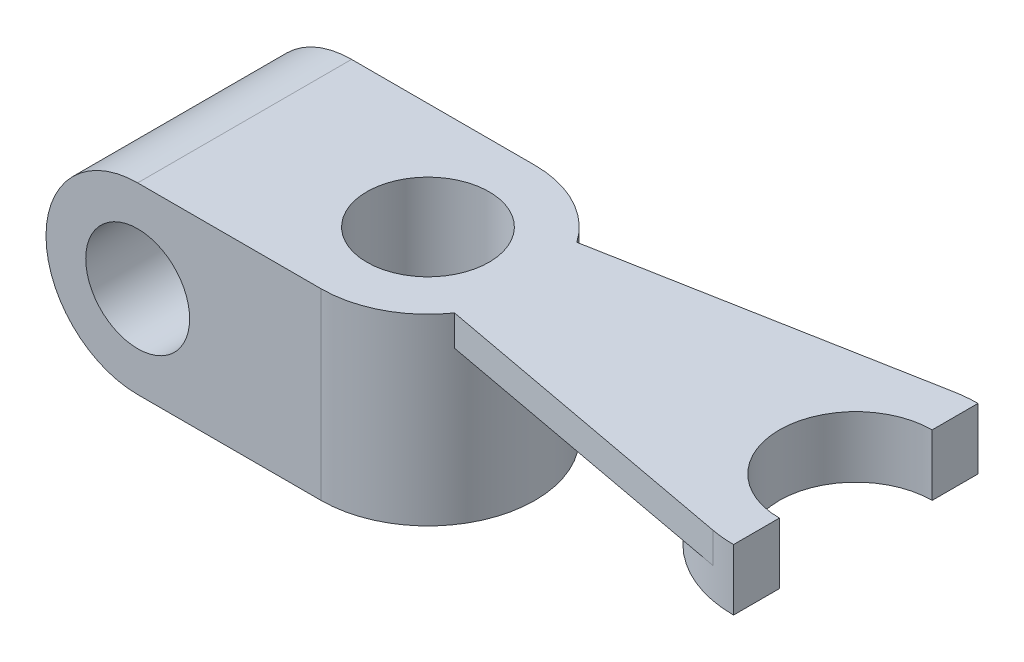
ISO-10303-21;
HEADER;
FILE_DESCRIPTION(('STEP AP214'),'2;1');
FILE_NAME('part.step','',(''),(''),'','','');
FILE_SCHEMA(('AUTOMOTIVE_DESIGN { 1 0 10303 214 1 1 1 1 }'));
ENDSEC;
DATA;
#1=APPLICATION_CONTEXT('core data for automotive mechanical design processes');
#2=APPLICATION_PROTOCOL_DEFINITION('international standard','automotive_design',2000,#1);
#3=PRODUCT_CONTEXT('',#1,'mechanical');
#4=PRODUCT('Part','Part','',(#3));
#5=PRODUCT_RELATED_PRODUCT_CATEGORY('part','',(#4));
#6=PRODUCT_DEFINITION_FORMATION('','',#4);
#7=PRODUCT_DEFINITION_CONTEXT('part definition',#1,'design');
#8=PRODUCT_DEFINITION('design','',#6,#7);
#9=PRODUCT_DEFINITION_SHAPE('','',#8);
#10=(LENGTH_UNIT() NAMED_UNIT(*) SI_UNIT(.MILLI.,.METRE.));
#11=(NAMED_UNIT(*) PLANE_ANGLE_UNIT() SI_UNIT($,.RADIAN.));
#12=(NAMED_UNIT(*) SI_UNIT($,.STERADIAN.) SOLID_ANGLE_UNIT());
#13=UNCERTAINTY_MEASURE_WITH_UNIT(LENGTH_MEASURE(1.E-05),#10,'distance_accuracy_value','');
#14=(GEOMETRIC_REPRESENTATION_CONTEXT(3) GLOBAL_UNCERTAINTY_ASSIGNED_CONTEXT((#13)) GLOBAL_UNIT_ASSIGNED_CONTEXT((#10,
#11,#12)) REPRESENTATION_CONTEXT('',''));
#15=CARTESIAN_POINT('',(0.,0.,0.));
#16=DIRECTION('',(0.,0.,1.));
#17=DIRECTION('',(1.,0.,0.));
#18=AXIS2_PLACEMENT_3D('',#15,#16,#17);
#19=CARTESIAN_POINT('',(-45.1702315148602,30.,35.));
#20=DIRECTION('',(0.,0.,1.));
#21=DIRECTION('',(1.,0.,0.));
#22=AXIS2_PLACEMENT_3D('',#19,#20,#21);
#23=CYLINDRICAL_SURFACE('',#22,30.);
#24=DIRECTION('',(0.,0.,1.));
#25=VECTOR('',#24,1.);
#26=CARTESIAN_POINT('',(-45.1702315148602,0.,0.));
#27=LINE('',#26,#25);
#28=CARTESIAN_POINT('',(-45.1702315148602,0.,35.));
#29=VERTEX_POINT('',#28);
#30=CARTESIAN_POINT('',(-45.1702315148602,0.,-35.));
#31=VERTEX_POINT('',#30);
#32=EDGE_CURVE('E229',#29,#31,#27,.F.);
#33=ORIENTED_EDGE('',*,*,#32,.F.);
#34=CARTESIAN_POINT('',(-45.1702315148602,30.,35.));
#35=DIRECTION('',(0.,0.,1.));
#36=DIRECTION('',(1.,0.,0.));
#37=AXIS2_PLACEMENT_3D('',#34,#35,#36);
#38=CIRCLE('',#37,30.);
#39=CARTESIAN_POINT('',(-45.1702315148602,60.,35.));
#40=VERTEX_POINT('',#39);
#41=EDGE_CURVE('E47',#40,#29,#38,.T.);
#42=ORIENTED_EDGE('',*,*,#41,.F.);
#43=DIRECTION('',(0.,0.,-1.));
#44=VECTOR('',#43,1.);
#45=CARTESIAN_POINT('',(-45.1702315148602,60.,35.));
#46=LINE('',#45,#44);
#47=CARTESIAN_POINT('',(-45.1702315148602,60.,-35.));
#48=VERTEX_POINT('',#47);
#49=EDGE_CURVE('E235',#48,#40,#46,.F.);
#50=ORIENTED_EDGE('',*,*,#49,.F.);
#51=CARTESIAN_POINT('',(-45.1702315148602,30.,-35.));
#52=DIRECTION('',(0.,0.,1.));
#53=DIRECTION('',(1.,0.,0.));
#54=AXIS2_PLACEMENT_3D('',#51,#52,#53);
#55=CIRCLE('',#54,30.);
#56=EDGE_CURVE('E11',#31,#48,#55,.F.);
#57=ORIENTED_EDGE('',*,*,#56,.F.);
#58=EDGE_LOOP('',(#33,#42,#50,#57));
#59=FACE_BOUND('',#58,.T.);
#60=ADVANCED_FACE('F39',(#59),#23,.T.);
#61=CARTESIAN_POINT('',(14.8297684851398,60.,0.));
#62=DIRECTION('',(0.,-1.,0.));
#63=DIRECTION('',(0.,0.,-1.));
#64=AXIS2_PLACEMENT_3D('',#61,#62,#63);
#65=CYLINDRICAL_SURFACE('',#64,35.);
#66=DIRECTION('',(0.,1.,0.));
#67=VECTOR('',#66,1.);
#68=CARTESIAN_POINT('',(43.5427871705261,50.,-20.0140590079238));
#69=LINE('',#68,#67);
#70=CARTESIAN_POINT('',(43.5427871705261,50.,-20.0140590079238));
#71=VERTEX_POINT('',#70);
#72=CARTESIAN_POINT('',(43.5427871705261,60.,-20.0140590079238));
#73=VERTEX_POINT('',#72);
#74=EDGE_CURVE('E191',#71,#73,#69,.T.);
#75=ORIENTED_EDGE('',*,*,#74,.F.);
#76=CARTESIAN_POINT('',(14.8297684851398,50.,0.));
#77=DIRECTION('',(0.,1.,0.));
#78=DIRECTION('',(0.,0.,1.));
#79=AXIS2_PLACEMENT_3D('',#76,#77,#78);
#80=CIRCLE('',#79,35.);
#81=CARTESIAN_POINT('',(43.542787175516,50.,20.0140590007651));
#82=VERTEX_POINT('',#81);
#83=EDGE_CURVE('E173',#82,#71,#80,.T.);
#84=ORIENTED_EDGE('',*,*,#83,.F.);
#85=DIRECTION('',(0.,1.,0.));
#86=VECTOR('',#85,1.);
#87=CARTESIAN_POINT('',(43.542787175516,50.,20.0140590007651));
#88=LINE('',#87,#86);
#89=CARTESIAN_POINT('',(43.542787175516,60.,20.0140590007651));
#90=VERTEX_POINT('',#89);
#91=EDGE_CURVE('E186',#82,#90,#88,.T.);
#92=ORIENTED_EDGE('',*,*,#91,.T.);
#93=CARTESIAN_POINT('',(14.8297684851398,60.,0.));
#94=DIRECTION('',(0.,1.,0.));
#95=DIRECTION('',(0.,0.,1.));
#96=AXIS2_PLACEMENT_3D('',#93,#94,#95);
#97=CIRCLE('',#96,35.);
#98=CARTESIAN_POINT('',(14.8297684851398,60.,35.));
#99=VERTEX_POINT('',#98);
#100=EDGE_CURVE('E206',#99,#90,#97,.T.);
#101=ORIENTED_EDGE('',*,*,#100,.F.);
#102=DIRECTION('',(0.,-1.,0.));
#103=VECTOR('',#102,1.);
#104=CARTESIAN_POINT('',(14.8297684851398,60.,35.));
#105=LINE('',#104,#103);
#106=CARTESIAN_POINT('',(14.8297684851398,0.,35.));
#107=VERTEX_POINT('',#106);
#108=EDGE_CURVE('E215',#99,#107,#105,.T.);
#109=ORIENTED_EDGE('',*,*,#108,.T.);
#110=CARTESIAN_POINT('',(14.8297684851398,0.,0.));
#111=DIRECTION('',(0.,1.,0.));
#112=DIRECTION('',(0.,0.,1.));
#113=AXIS2_PLACEMENT_3D('',#110,#111,#112);
#114=CIRCLE('',#113,35.);
#115=CARTESIAN_POINT('',(14.8297684851398,0.,-35.));
#116=VERTEX_POINT('',#115);
#117=EDGE_CURVE('E218',#107,#116,#114,.T.);
#118=ORIENTED_EDGE('',*,*,#117,.T.);
#119=DIRECTION('',(0.,-1.,0.));
#120=VECTOR('',#119,1.);
#121=CARTESIAN_POINT('',(14.8297684851398,60.,-35.));
#122=LINE('',#121,#120);
#123=CARTESIAN_POINT('',(14.8297684851398,60.,-35.));
#124=VERTEX_POINT('',#123);
#125=EDGE_CURVE('E226',#124,#116,#122,.T.);
#126=ORIENTED_EDGE('',*,*,#125,.F.);
#127=EDGE_CURVE('E204',#73,#124,#97,.T.);
#128=ORIENTED_EDGE('',*,*,#127,.F.);
#129=EDGE_LOOP('',(#75,#84,#92,#101,#109,#118,#126,#128));
#130=FACE_BOUND('',#129,.T.);
#131=ADVANCED_FACE('F246',(#130),#65,.T.);
#132=CARTESIAN_POINT('',(0.,60.,-35.));
#133=DIRECTION('',(0.,0.,1.));
#134=DIRECTION('',(1.,0.,0.));
#135=AXIS2_PLACEMENT_3D('',#132,#133,#134);
#136=PLANE('',#135);
#137=CARTESIAN_POINT('',(-45.1702315148602,30.,-35.));
#138=DIRECTION('',(0.,0.,-1.));
#139=DIRECTION('',(-1.,0.,0.));
#140=AXIS2_PLACEMENT_3D('',#137,#138,#139);
#141=CIRCLE('',#140,17.);
#142=CARTESIAN_POINT('',(-62.1702315148602,30.,-35.));
#143=VERTEX_POINT('',#142);
#144=EDGE_CURVE('E157',#143,#143,#141,.T.);
#145=ORIENTED_EDGE('',*,*,#144,.F.);
#146=EDGE_LOOP('',(#145));
#147=FACE_BOUND('',#146,.T.);
#148=DIRECTION('',(-1.,0.,0.));
#149=VECTOR('',#148,1.);
#150=CARTESIAN_POINT('',(0.,0.,-35.));
#151=LINE('',#150,#149);
#152=EDGE_CURVE('E221',#116,#31,#151,.T.);
#153=ORIENTED_EDGE('',*,*,#152,.T.);
#154=ORIENTED_EDGE('',*,*,#56,.T.);
#155=DIRECTION('',(-1.,0.,0.));
#156=VECTOR('',#155,1.);
#157=CARTESIAN_POINT('',(0.,60.,-35.));
#158=LINE('',#157,#156);
#159=EDGE_CURVE('E209',#124,#48,#158,.T.);
#160=ORIENTED_EDGE('',*,*,#159,.F.);
#161=ORIENTED_EDGE('',*,*,#125,.T.);
#162=EDGE_LOOP('',(#153,#154,#160,#161));
#163=FACE_BOUND('',#162,.T.);
#164=ADVANCED_FACE('F253',(#147,#163),#136,.F.);
#165=CARTESIAN_POINT('',(14.8297684851398,60.,0.));
#166=DIRECTION('',(0.,-1.,0.));
#167=DIRECTION('',(0.,0.,-1.));
#168=AXIS2_PLACEMENT_3D('',#165,#166,#167);
#169=CYLINDRICAL_SURFACE('',#168,20.);
#170=CARTESIAN_POINT('',(14.8297684851398,60.,0.));
#171=DIRECTION('',(0.,1.,0.));
#172=DIRECTION('',(0.,0.,1.));
#173=AXIS2_PLACEMENT_3D('',#170,#171,#172);
#174=CIRCLE('',#173,20.);
#175=CARTESIAN_POINT('',(14.8297684851398,60.,20.));
#176=VERTEX_POINT('',#175);
#177=EDGE_CURVE('E201',#176,#176,#174,.T.);
#178=ORIENTED_EDGE('',*,*,#177,.T.);
#179=EDGE_LOOP('',(#178));
#180=FACE_BOUND('',#179,.T.);
#181=CARTESIAN_POINT('',(14.8297684851398,0.,0.));
#182=DIRECTION('',(0.,1.,0.));
#183=DIRECTION('',(0.,0.,1.));
#184=AXIS2_PLACEMENT_3D('',#181,#182,#183);
#185=CIRCLE('',#184,20.);
#186=CARTESIAN_POINT('',(14.8297684851398,0.,20.));
#187=VERTEX_POINT('',#186);
#188=EDGE_CURVE('E193',#187,#187,#185,.T.);
#189=ORIENTED_EDGE('',*,*,#188,.F.);
#190=EDGE_LOOP('',(#189));
#191=FACE_BOUND('',#190,.T.);
#192=ADVANCED_FACE('F255',(#180,#191),#169,.F.);
#193=CARTESIAN_POINT('',(0.,60.,35.));
#194=DIRECTION('',(0.,0.,1.));
#195=DIRECTION('',(1.,0.,0.));
#196=AXIS2_PLACEMENT_3D('',#193,#194,#195);
#197=PLANE('',#196);
#198=CARTESIAN_POINT('',(-45.1702315148602,30.,35.));
#199=DIRECTION('',(0.,0.,1.));
#200=DIRECTION('',(1.,0.,0.));
#201=AXIS2_PLACEMENT_3D('',#198,#199,#200);
#202=CIRCLE('',#201,17.);
#203=CARTESIAN_POINT('',(-28.1702315148602,30.,35.));
#204=VERTEX_POINT('',#203);
#205=EDGE_CURVE('E230',#204,#204,#202,.T.);
#206=ORIENTED_EDGE('',*,*,#205,.F.);
#207=EDGE_LOOP('',(#206));
#208=FACE_BOUND('',#207,.T.);
#209=DIRECTION('',(-1.,0.,0.));
#210=VECTOR('',#209,1.);
#211=CARTESIAN_POINT('',(0.,60.,35.));
#212=LINE('',#211,#210);
#213=EDGE_CURVE('E212',#99,#40,#212,.T.);
#214=ORIENTED_EDGE('',*,*,#213,.T.);
#215=ORIENTED_EDGE('',*,*,#41,.T.);
#216=DIRECTION('',(-1.,0.,0.));
#217=VECTOR('',#216,1.);
#218=CARTESIAN_POINT('',(0.,0.,35.));
#219=LINE('',#218,#217);
#220=EDGE_CURVE('E205',#107,#29,#219,.T.);
#221=ORIENTED_EDGE('',*,*,#220,.F.);
#222=ORIENTED_EDGE('',*,*,#108,.F.);
#223=EDGE_LOOP('',(#214,#215,#221,#222));
#224=FACE_BOUND('',#223,.T.);
#225=ADVANCED_FACE('F238',(#208,#224),#197,.T.);
#226=CARTESIAN_POINT('',(0.,60.,0.));
#227=DIRECTION('',(0.,1.,0.));
#228=DIRECTION('',(0.,0.,1.));
#229=AXIS2_PLACEMENT_3D('',#226,#227,#228);
#230=PLANE('',#229);
#231=ORIENTED_EDGE('',*,*,#177,.F.);
#232=EDGE_LOOP('',(#231));
#233=FACE_BOUND('',#232,.T.);
#234=ORIENTED_EDGE('',*,*,#159,.T.);
#235=ORIENTED_EDGE('',*,*,#49,.T.);
#236=ORIENTED_EDGE('',*,*,#213,.F.);
#237=ORIENTED_EDGE('',*,*,#100,.T.);
#238=DIRECTION('',(0.983184838144241,0.,0.182613181460932));
#239=VECTOR('',#238,1.);
#240=CARTESIAN_POINT('',(-2.14132809407011,60.,11.5288573296799));
#241=LINE('',#240,#239);
#242=CARTESIAN_POINT('',(147.496172073168,60.,39.3219832112562));
#243=VERTEX_POINT('',#242);
#244=EDGE_CURVE('E169',#90,#243,#241,.T.);
#245=ORIENTED_EDGE('',*,*,#244,.T.);
#246=CARTESIAN_POINT('',(154.82976848514,60.,0.));
#247=DIRECTION('',(0.,1.,0.));
#248=DIRECTION('',(0.,0.,1.));
#249=AXIS2_PLACEMENT_3D('',#246,#247,#248);
#250=CIRCLE('',#249,40.);
#251=CARTESIAN_POINT('',(154.82976848514,60.,40.));
#252=VERTEX_POINT('',#251);
#253=EDGE_CURVE('E164',#243,#252,#250,.T.);
#254=ORIENTED_EDGE('',*,*,#253,.T.);
#255=DIRECTION('',(0.,0.,-1.));
#256=VECTOR('',#255,1.);
#257=CARTESIAN_POINT('',(154.82976848514,60.,25.));
#258=LINE('',#257,#256);
#259=CARTESIAN_POINT('',(154.82976848514,60.,25.));
#260=VERTEX_POINT('',#259);
#261=EDGE_CURVE('E132',#252,#260,#258,.T.);
#262=ORIENTED_EDGE('',*,*,#261,.T.);
#263=CARTESIAN_POINT('',(154.82976848514,60.,0.));
#264=DIRECTION('',(0.,-1.,0.));
#265=DIRECTION('',(0.,0.,1.));
#266=AXIS2_PLACEMENT_3D('',#263,#264,#265);
#267=CIRCLE('',#266,25.);
#268=CARTESIAN_POINT('',(154.82976848514,60.,-25.));
#269=VERTEX_POINT('',#268);
#270=EDGE_CURVE('E154',#260,#269,#267,.T.);
#271=ORIENTED_EDGE('',*,*,#270,.T.);
#272=DIRECTION('',(0.,0.,-1.));
#273=VECTOR('',#272,1.);
#274=CARTESIAN_POINT('',(154.82976848514,60.,-40.));
#275=LINE('',#274,#273);
#276=CARTESIAN_POINT('',(154.82976848514,60.,-40.));
#277=VERTEX_POINT('',#276);
#278=EDGE_CURVE('E151',#269,#277,#275,.T.);
#279=ORIENTED_EDGE('',*,*,#278,.T.);
#280=CARTESIAN_POINT('',(147.525237165839,60.,-39.3273927715194));
#281=VERTEX_POINT('',#280);
#282=EDGE_CURVE('E161',#277,#281,#250,.T.);
#283=ORIENTED_EDGE('',*,*,#282,.T.);
#284=DIRECTION('',(0.983184819287985,0.,-0.182613282982515));
#285=VECTOR('',#284,1.);
#286=CARTESIAN_POINT('',(-2.14132840980273,60.,-11.5288523991418));
#287=LINE('',#286,#285);
#288=EDGE_CURVE('E177',#73,#281,#287,.T.);
#289=ORIENTED_EDGE('',*,*,#288,.F.);
#290=ORIENTED_EDGE('',*,*,#127,.T.);
#291=EDGE_LOOP('',(#234,#235,#236,#237,#245,#254,#262,#271,#279,#283,#289,#290));
#292=FACE_BOUND('',#291,.T.);
#293=ADVANCED_FACE('F251',(#233,#292),#230,.T.);
#294=CARTESIAN_POINT('',(0.,0.,0.));
#295=DIRECTION('',(0.,1.,0.));
#296=DIRECTION('',(0.,0.,1.));
#297=AXIS2_PLACEMENT_3D('',#294,#295,#296);
#298=PLANE('',#297);
#299=ORIENTED_EDGE('',*,*,#188,.T.);
#300=EDGE_LOOP('',(#299));
#301=FACE_BOUND('',#300,.T.);
#302=ORIENTED_EDGE('',*,*,#220,.T.);
#303=ORIENTED_EDGE('',*,*,#32,.T.);
#304=ORIENTED_EDGE('',*,*,#152,.F.);
#305=ORIENTED_EDGE('',*,*,#117,.F.);
#306=EDGE_LOOP('',(#302,#303,#304,#305));
#307=FACE_BOUND('',#306,.T.);
#308=ADVANCED_FACE('F242',(#301,#307),#298,.F.);
#309=CARTESIAN_POINT('',(-2.14132840980273,50.,-11.5288523991418));
#310=DIRECTION('',(0.182613282982515,0.,0.983184819287985));
#311=DIRECTION('',(0.983184819287985,0.,-0.182613282982515));
#312=AXIS2_PLACEMENT_3D('',#309,#310,#311);
#313=PLANE('',#312);
#314=ORIENTED_EDGE('',*,*,#288,.T.);
#315=DIRECTION('',(0.,1.,0.));
#316=VECTOR('',#315,1.);
#317=CARTESIAN_POINT('',(147.525237165839,50.,-39.3273927715194));
#318=LINE('',#317,#316);
#319=CARTESIAN_POINT('',(147.525237165839,50.,-39.3273927715194));
#320=VERTEX_POINT('',#319);
#321=EDGE_CURVE('E194',#320,#281,#318,.T.);
#322=ORIENTED_EDGE('',*,*,#321,.F.);
#323=DIRECTION('',(0.983184819287985,0.,-0.182613282982515));
#324=VECTOR('',#323,1.);
#325=CARTESIAN_POINT('',(-2.14132840980273,50.,-11.5288523991418));
#326=LINE('',#325,#324);
#327=EDGE_CURVE('E183',#71,#320,#326,.T.);
#328=ORIENTED_EDGE('',*,*,#327,.F.);
#329=ORIENTED_EDGE('',*,*,#74,.T.);
#330=EDGE_LOOP('',(#314,#322,#328,#329));
#331=FACE_BOUND('',#330,.T.);
#332=ADVANCED_FACE('F284',(#331),#313,.F.);
#333=CARTESIAN_POINT('',(-2.14132809407011,50.,11.5288573296799));
#334=DIRECTION('',(-0.182613181460932,0.,0.983184838144241));
#335=DIRECTION('',(0.983184838144241,0.,0.182613181460932));
#336=AXIS2_PLACEMENT_3D('',#333,#334,#335);
#337=PLANE('',#336);
#338=ORIENTED_EDGE('',*,*,#244,.F.);
#339=ORIENTED_EDGE('',*,*,#91,.F.);
#340=DIRECTION('',(0.983184838144241,0.,0.182613181460932));
#341=VECTOR('',#340,1.);
#342=CARTESIAN_POINT('',(-2.14132809407011,50.,11.5288573296799));
#343=LINE('',#342,#341);
#344=CARTESIAN_POINT('',(147.496172073157,50.,39.3219832112541));
#345=VERTEX_POINT('',#344);
#346=EDGE_CURVE('E176',#82,#345,#343,.T.);
#347=ORIENTED_EDGE('',*,*,#346,.T.);
#348=DIRECTION('',(0.,1.,0.));
#349=VECTOR('',#348,1.);
#350=CARTESIAN_POINT('',(147.496172073157,50.,39.3219832112541));
#351=LINE('',#350,#349);
#352=EDGE_CURVE('E196',#345,#243,#351,.T.);
#353=ORIENTED_EDGE('',*,*,#352,.T.);
#354=EDGE_LOOP('',(#338,#339,#347,#353));
#355=FACE_BOUND('',#354,.T.);
#356=ADVANCED_FACE('F289',(#355),#337,.T.);
#357=CARTESIAN_POINT('',(0.,50.,0.));
#358=DIRECTION('',(0.,1.,0.));
#359=DIRECTION('',(0.,0.,1.));
#360=AXIS2_PLACEMENT_3D('',#357,#358,#359);
#361=PLANE('',#360);
#362=ORIENTED_EDGE('',*,*,#83,.T.);
#363=ORIENTED_EDGE('',*,*,#327,.T.);
#364=CARTESIAN_POINT('',(154.82976848514,50.,0.));
#365=DIRECTION('',(0.,1.,0.));
#366=DIRECTION('',(0.,0.,1.));
#367=AXIS2_PLACEMENT_3D('',#364,#365,#366);
#368=CIRCLE('',#367,40.);
#369=EDGE_CURVE('E180',#320,#345,#368,.T.);
#370=ORIENTED_EDGE('',*,*,#369,.T.);
#371=ORIENTED_EDGE('',*,*,#346,.F.);
#372=EDGE_LOOP('',(#362,#363,#370,#371));
#373=FACE_BOUND('',#372,.T.);
#374=ADVANCED_FACE('F301',(#373),#361,.F.);
#375=CARTESIAN_POINT('',(154.82976848514,40.,0.));
#376=DIRECTION('',(0.,1.,0.));
#377=DIRECTION('',(0.,0.,1.));
#378=AXIS2_PLACEMENT_3D('',#375,#376,#377);
#379=CYLINDRICAL_SURFACE('',#378,40.);
#380=ORIENTED_EDGE('',*,*,#369,.F.);
#381=ORIENTED_EDGE('',*,*,#321,.T.);
#382=ORIENTED_EDGE('',*,*,#282,.F.);
#383=DIRECTION('',(0.,1.,0.));
#384=VECTOR('',#383,1.);
#385=CARTESIAN_POINT('',(154.82976848514,40.,-40.));
#386=LINE('',#385,#384);
#387=CARTESIAN_POINT('',(154.82976848514,40.,-40.));
#388=VERTEX_POINT('',#387);
#389=EDGE_CURVE('E150',#388,#277,#386,.T.);
#390=ORIENTED_EDGE('',*,*,#389,.F.);
#391=CARTESIAN_POINT('',(154.82976848514,40.,0.));
#392=DIRECTION('',(0.,1.,0.));
#393=DIRECTION('',(0.,0.,1.));
#394=AXIS2_PLACEMENT_3D('',#391,#392,#393);
#395=CIRCLE('',#394,40.);
#396=CARTESIAN_POINT('',(154.82976848514,40.,40.));
#397=VERTEX_POINT('',#396);
#398=EDGE_CURVE('E143',#388,#397,#395,.T.);
#399=ORIENTED_EDGE('',*,*,#398,.T.);
#400=DIRECTION('',(0.,1.,0.));
#401=VECTOR('',#400,1.);
#402=CARTESIAN_POINT('',(154.82976848514,40.,40.));
#403=LINE('',#402,#401);
#404=EDGE_CURVE('E127',#397,#252,#403,.T.);
#405=ORIENTED_EDGE('',*,*,#404,.T.);
#406=ORIENTED_EDGE('',*,*,#253,.F.);
#407=ORIENTED_EDGE('',*,*,#352,.F.);
#408=EDGE_LOOP('',(#380,#381,#382,#390,#399,#405,#406,#407));
#409=FACE_BOUND('',#408,.T.);
#410=ADVANCED_FACE('F148',(#409),#379,.T.);
#411=CARTESIAN_POINT('',(154.82976848514,40.,-40.));
#412=DIRECTION('',(1.,0.,0.));
#413=DIRECTION('',(0.,0.,-1.));
#414=AXIS2_PLACEMENT_3D('',#411,#412,#413);
#415=PLANE('',#414);
#416=ORIENTED_EDGE('',*,*,#278,.F.);
#417=DIRECTION('',(0.,1.,0.));
#418=VECTOR('',#417,1.);
#419=CARTESIAN_POINT('',(154.82976848514,40.,-25.));
#420=LINE('',#419,#418);
#421=CARTESIAN_POINT('',(154.82976848514,40.,-25.));
#422=VERTEX_POINT('',#421);
#423=EDGE_CURVE('E170',#422,#269,#420,.T.);
#424=ORIENTED_EDGE('',*,*,#423,.F.);
#425=DIRECTION('',(0.,0.,-1.));
#426=VECTOR('',#425,1.);
#427=CARTESIAN_POINT('',(154.82976848514,40.,-40.));
#428=LINE('',#427,#426);
#429=EDGE_CURVE('E136',#422,#388,#428,.T.);
#430=ORIENTED_EDGE('',*,*,#429,.T.);
#431=ORIENTED_EDGE('',*,*,#389,.T.);
#432=EDGE_LOOP('',(#416,#424,#430,#431));
#433=FACE_BOUND('',#432,.T.);
#434=ADVANCED_FACE('F322',(#433),#415,.T.);
#435=CARTESIAN_POINT('',(154.82976848514,40.,0.));
#436=DIRECTION('',(0.,1.,0.));
#437=DIRECTION('',(0.,0.,1.));
#438=AXIS2_PLACEMENT_3D('',#435,#436,#437);
#439=CYLINDRICAL_SURFACE('',#438,25.);
#440=ORIENTED_EDGE('',*,*,#270,.F.);
#441=DIRECTION('',(0.,1.,0.));
#442=VECTOR('',#441,1.);
#443=CARTESIAN_POINT('',(154.82976848514,40.,25.));
#444=LINE('',#443,#442);
#445=CARTESIAN_POINT('',(154.82976848514,40.,25.));
#446=VERTEX_POINT('',#445);
#447=EDGE_CURVE('E135',#446,#260,#444,.T.);
#448=ORIENTED_EDGE('',*,*,#447,.F.);
#449=CARTESIAN_POINT('',(154.82976848514,40.,0.));
#450=DIRECTION('',(0.,-1.,0.));
#451=DIRECTION('',(0.,0.,1.));
#452=AXIS2_PLACEMENT_3D('',#449,#450,#451);
#453=CIRCLE('',#452,25.);
#454=EDGE_CURVE('E146',#446,#422,#453,.T.);
#455=ORIENTED_EDGE('',*,*,#454,.T.);
#456=ORIENTED_EDGE('',*,*,#423,.T.);
#457=EDGE_LOOP('',(#440,#448,#455,#456));
#458=FACE_BOUND('',#457,.T.);
#459=ADVANCED_FACE('F331',(#458),#439,.F.);
#460=CARTESIAN_POINT('',(154.82976848514,40.,25.));
#461=DIRECTION('',(1.,0.,0.));
#462=DIRECTION('',(0.,0.,-1.));
#463=AXIS2_PLACEMENT_3D('',#460,#461,#462);
#464=PLANE('',#463);
#465=ORIENTED_EDGE('',*,*,#261,.F.);
#466=ORIENTED_EDGE('',*,*,#404,.F.);
#467=DIRECTION('',(0.,0.,-1.));
#468=VECTOR('',#467,1.);
#469=CARTESIAN_POINT('',(154.82976848514,40.,25.));
#470=LINE('',#469,#468);
#471=EDGE_CURVE('E130',#397,#446,#470,.T.);
#472=ORIENTED_EDGE('',*,*,#471,.T.);
#473=ORIENTED_EDGE('',*,*,#447,.T.);
#474=EDGE_LOOP('',(#465,#466,#472,#473));
#475=FACE_BOUND('',#474,.T.);
#476=ADVANCED_FACE('F129',(#475),#464,.T.);
#477=CARTESIAN_POINT('',(154.82976848514,40.,0.));
#478=DIRECTION('',(0.,1.,0.));
#479=DIRECTION('',(0.,0.,1.));
#480=AXIS2_PLACEMENT_3D('',#477,#478,#479);
#481=PLANE('',#480);
#482=ORIENTED_EDGE('',*,*,#398,.F.);
#483=ORIENTED_EDGE('',*,*,#429,.F.);
#484=ORIENTED_EDGE('',*,*,#454,.F.);
#485=ORIENTED_EDGE('',*,*,#471,.F.);
#486=EDGE_LOOP('',(#482,#483,#484,#485));
#487=FACE_BOUND('',#486,.T.);
#488=ADVANCED_FACE('F141',(#487),#481,.F.);
#489=CARTESIAN_POINT('',(-45.1702315148602,30.,67.0000000000001));
#490=DIRECTION('',(0.,0.,-1.));
#491=DIRECTION('',(-1.,0.,0.));
#492=AXIS2_PLACEMENT_3D('',#489,#490,#491);
#493=CYLINDRICAL_SURFACE('',#492,17.);
#494=ORIENTED_EDGE('',*,*,#205,.T.);
#495=EDGE_LOOP('',(#494));
#496=FACE_BOUND('',#495,.T.);
#497=ORIENTED_EDGE('',*,*,#144,.T.);
#498=EDGE_LOOP('',(#497));
#499=FACE_BOUND('',#498,.T.);
#500=ADVANCED_FACE('F357',(#496,#499),#493,.F.);
#501=CLOSED_SHELL('',(#60,#131,#164,#192,#225,#293,#308,#332,#356,#374,#410,#434,#459,#476,#488,#500));
#502=MANIFOLD_SOLID_BREP('B2',#501);
#503=ADVANCED_BREP_SHAPE_REPRESENTATION('',(#18,#502),#14);
#504=SHAPE_DEFINITION_REPRESENTATION(#9,#503);
ENDSEC;
END-ISO-10303-21;
